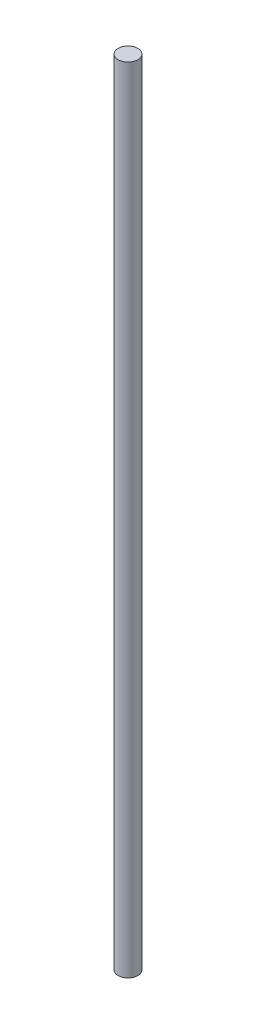
ISO-10303-21;
HEADER;
FILE_DESCRIPTION(('STEP AP214'),'2;1');
FILE_NAME('part.step','',(''),(''),'','','');
FILE_SCHEMA(('AUTOMOTIVE_DESIGN { 1 0 10303 214 1 1 1 1 }'));
ENDSEC;
DATA;
#1=APPLICATION_CONTEXT('core data for automotive mechanical design processes');
#2=APPLICATION_PROTOCOL_DEFINITION('international standard','automotive_design',2000,#1);
#3=PRODUCT_CONTEXT('',#1,'mechanical');
#4=PRODUCT('Part','Part','',(#3));
#5=PRODUCT_RELATED_PRODUCT_CATEGORY('part','',(#4));
#6=PRODUCT_DEFINITION_FORMATION('','',#4);
#7=PRODUCT_DEFINITION_CONTEXT('part definition',#1,'design');
#8=PRODUCT_DEFINITION('design','',#6,#7);
#9=PRODUCT_DEFINITION_SHAPE('','',#8);
#10=(LENGTH_UNIT() NAMED_UNIT(*) SI_UNIT(.MILLI.,.METRE.));
#11=(NAMED_UNIT(*) PLANE_ANGLE_UNIT() SI_UNIT($,.RADIAN.));
#12=(NAMED_UNIT(*) SI_UNIT($,.STERADIAN.) SOLID_ANGLE_UNIT());
#13=UNCERTAINTY_MEASURE_WITH_UNIT(LENGTH_MEASURE(1.E-05),#10,'distance_accuracy_value','');
#14=(GEOMETRIC_REPRESENTATION_CONTEXT(3) GLOBAL_UNCERTAINTY_ASSIGNED_CONTEXT((#13)) GLOBAL_UNIT_ASSIGNED_CONTEXT((#10,
#11,#12)) REPRESENTATION_CONTEXT('',''));
#15=CARTESIAN_POINT('',(0.,0.,0.));
#16=DIRECTION('',(0.,0.,1.));
#17=DIRECTION('',(1.,0.,0.));
#18=AXIS2_PLACEMENT_3D('',#15,#16,#17);
#19=CARTESIAN_POINT('',(0.,408.94,0.));
#20=DIRECTION('',(0.,-1.,0.));
#21=DIRECTION('',(0.,0.,-1.00000000000001));
#22=AXIS2_PLACEMENT_3D('',#19,#20,#21);
#23=CYLINDRICAL_SURFACE('',#22,5.08);
#24=CARTESIAN_POINT('',(0.,408.94,0.));
#25=DIRECTION('',(0.,1.,0.));
#26=DIRECTION('',(0.,0.,1.00000000000001));
#27=AXIS2_PLACEMENT_3D('',#24,#25,#26);
#28=CIRCLE('',#27,5.08);
#29=CARTESIAN_POINT('',(0.,408.94,5.08000000000005));
#30=VERTEX_POINT('',#29);
#31=EDGE_CURVE('E12',#30,#30,#28,.T.);
#32=ORIENTED_EDGE('',*,*,#31,.F.);
#33=EDGE_LOOP('',(#32));
#34=FACE_BOUND('',#33,.T.);
#35=CARTESIAN_POINT('',(0.,0.,0.));
#36=DIRECTION('',(0.,1.,0.));
#37=DIRECTION('',(0.,0.,1.00000000000001));
#38=AXIS2_PLACEMENT_3D('',#35,#36,#37);
#39=CIRCLE('',#38,5.08);
#40=CARTESIAN_POINT('',(0.,0.,5.08000000000005));
#41=VERTEX_POINT('',#40);
#42=EDGE_CURVE('E49',#41,#41,#39,.T.);
#43=ORIENTED_EDGE('',*,*,#42,.T.);
#44=EDGE_LOOP('',(#43));
#45=FACE_BOUND('',#44,.T.);
#46=ADVANCED_FACE('F46',(#34,#45),#23,.T.);
#47=CARTESIAN_POINT('',(0.,408.94,0.));
#48=DIRECTION('',(0.,1.,0.));
#49=DIRECTION('',(0.,0.,1.00000000000001));
#50=AXIS2_PLACEMENT_3D('',#47,#48,#49);
#51=PLANE('',#50);
#52=ORIENTED_EDGE('',*,*,#31,.T.);
#53=EDGE_LOOP('',(#52));
#54=FACE_BOUND('',#53,.T.);
#55=ADVANCED_FACE('F61',(#54),#51,.T.);
#56=CARTESIAN_POINT('',(0.,0.,0.));
#57=DIRECTION('',(0.,1.,0.));
#58=DIRECTION('',(0.,0.,1.00000000000001));
#59=AXIS2_PLACEMENT_3D('',#56,#57,#58);
#60=PLANE('',#59);
#61=ORIENTED_EDGE('',*,*,#42,.F.);
#62=EDGE_LOOP('',(#61));
#63=FACE_BOUND('',#62,.T.);
#64=ADVANCED_FACE('F59',(#63),#60,.F.);
#65=CLOSED_SHELL('',(#46,#55,#64));
#66=MANIFOLD_SOLID_BREP('B2',#65);
#67=ADVANCED_BREP_SHAPE_REPRESENTATION('',(#18,#66),#14);
#68=SHAPE_DEFINITION_REPRESENTATION(#9,#67);
ENDSEC;
END-ISO-10303-21;
